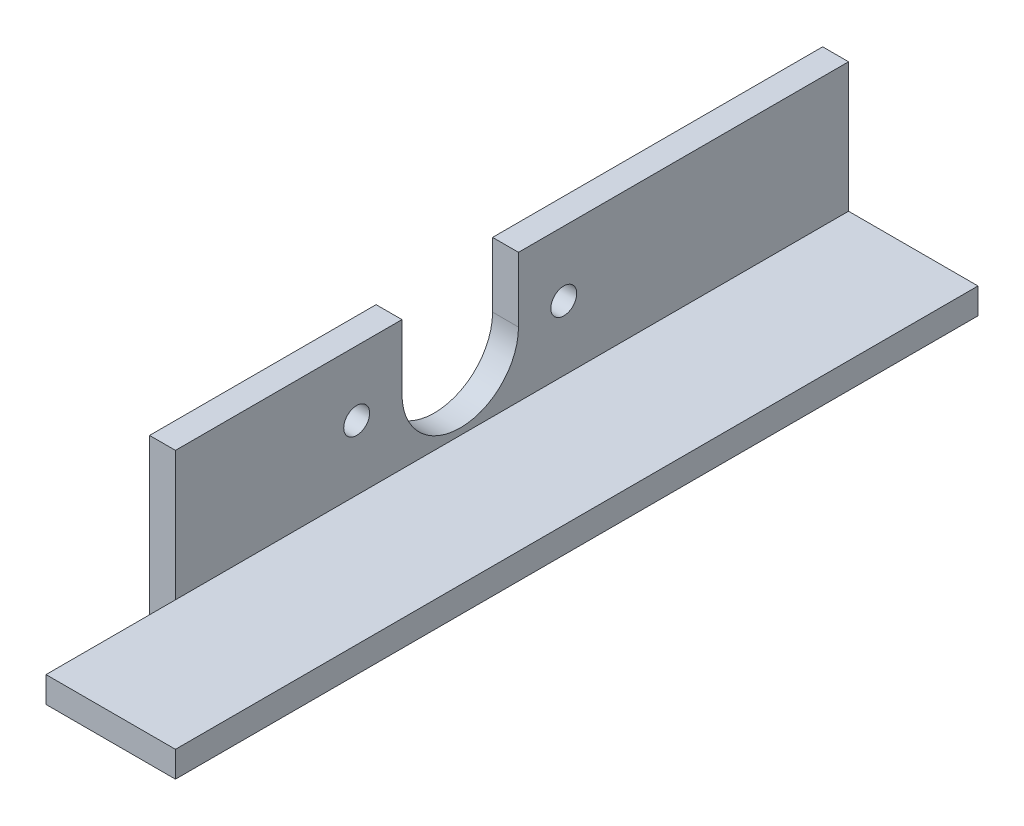
ISO-10303-21;
HEADER;
FILE_DESCRIPTION(('STEP AP214'),'2;1');
FILE_NAME('part.step','',(''),(''),'','','');
FILE_SCHEMA(('AUTOMOTIVE_DESIGN { 1 0 10303 214 1 1 1 1 }'));
ENDSEC;
DATA;
#1=APPLICATION_CONTEXT('core data for automotive mechanical design processes');
#2=APPLICATION_PROTOCOL_DEFINITION('international standard','automotive_design',2000,#1);
#3=PRODUCT_CONTEXT('',#1,'mechanical');
#4=PRODUCT('Part','Part','',(#3));
#5=PRODUCT_RELATED_PRODUCT_CATEGORY('part','',(#4));
#6=PRODUCT_DEFINITION_FORMATION('','',#4);
#7=PRODUCT_DEFINITION_CONTEXT('part definition',#1,'design');
#8=PRODUCT_DEFINITION('design','',#6,#7);
#9=PRODUCT_DEFINITION_SHAPE('','',#8);
#10=(LENGTH_UNIT() NAMED_UNIT(*) SI_UNIT(.MILLI.,.METRE.));
#11=(NAMED_UNIT(*) PLANE_ANGLE_UNIT() SI_UNIT($,.RADIAN.));
#12=(NAMED_UNIT(*) SI_UNIT($,.STERADIAN.) SOLID_ANGLE_UNIT());
#13=UNCERTAINTY_MEASURE_WITH_UNIT(LENGTH_MEASURE(1.E-05),#10,'distance_accuracy_value','');
#14=(GEOMETRIC_REPRESENTATION_CONTEXT(3) GLOBAL_UNCERTAINTY_ASSIGNED_CONTEXT((#13)) GLOBAL_UNIT_ASSIGNED_CONTEXT((#10,
#11,#12)) REPRESENTATION_CONTEXT('',''));
#15=CARTESIAN_POINT('',(0.,0.,0.));
#16=DIRECTION('',(0.,0.,1.));
#17=DIRECTION('',(1.,0.,0.));
#18=AXIS2_PLACEMENT_3D('',#15,#16,#17);
#19=CARTESIAN_POINT('',(0.,38.1,196.85));
#20=DIRECTION('',(0.,-1.,0.));
#21=DIRECTION('',(0.,0.,-1.));
#22=AXIS2_PLACEMENT_3D('',#19,#20,#21);
#23=PLANE('',#22);
#24=DIRECTION('',(0.,0.,-1.));
#25=VECTOR('',#24,1.);
#26=CARTESIAN_POINT('',(6.35,38.1,196.85));
#27=LINE('',#26,#25);
#28=CARTESIAN_POINT('',(6.35,38.1,165.1));
#29=VERTEX_POINT('',#28);
#30=CARTESIAN_POINT('',(6.35,38.1,109.5375));
#31=VERTEX_POINT('',#30);
#32=EDGE_CURVE('E237',#29,#31,#27,.T.);
#33=ORIENTED_EDGE('',*,*,#32,.T.);
#34=DIRECTION('',(1.,0.,0.));
#35=VECTOR('',#34,1.);
#36=CARTESIAN_POINT('',(0.,38.1,109.5375));
#37=LINE('',#36,#35);
#38=CARTESIAN_POINT('',(0.,38.1,109.5375));
#39=VERTEX_POINT('',#38);
#40=EDGE_CURVE('E174',#39,#31,#37,.T.);
#41=ORIENTED_EDGE('',*,*,#40,.F.);
#42=DIRECTION('',(0.,0.,-1.));
#43=VECTOR('',#42,1.);
#44=CARTESIAN_POINT('',(0.,38.1,196.85));
#45=LINE('',#44,#43);
#46=CARTESIAN_POINT('',(0.,38.1,165.1));
#47=VERTEX_POINT('',#46);
#48=EDGE_CURVE('E233',#47,#39,#45,.T.);
#49=ORIENTED_EDGE('',*,*,#48,.F.);
#50=DIRECTION('',(-1.,0.,0.));
#51=VECTOR('',#50,1.);
#52=CARTESIAN_POINT('',(6.35,38.1,165.1));
#53=LINE('',#52,#51);
#54=EDGE_CURVE('E186',#29,#47,#53,.T.);
#55=ORIENTED_EDGE('',*,*,#54,.F.);
#56=EDGE_LOOP('',(#33,#41,#49,#55));
#57=FACE_BOUND('',#56,.T.);
#58=ADVANCED_FACE('F45',(#57),#23,.F.);
#59=CARTESIAN_POINT('',(0.,0.,196.85));
#60=DIRECTION('',(0.,1.,0.));
#61=DIRECTION('',(-1.,0.,0.));
#62=AXIS2_PLACEMENT_3D('',#59,#60,#61);
#63=PLANE('',#62);
#64=DIRECTION('',(-1.,0.,0.));
#65=VECTOR('',#64,1.);
#66=CARTESIAN_POINT('',(6.35,4.16333634234434E-13,165.1));
#67=LINE('',#66,#65);
#68=CARTESIAN_POINT('',(6.35,4.16333634234434E-13,165.1));
#69=VERTEX_POINT('',#68);
#70=CARTESIAN_POINT('',(0.,4.16333634234434E-13,165.1));
#71=VERTEX_POINT('',#70);
#72=EDGE_CURVE('E192',#69,#71,#67,.T.);
#73=ORIENTED_EDGE('',*,*,#72,.T.);
#74=DIRECTION('',(0.,0.,-1.));
#75=VECTOR('',#74,1.);
#76=CARTESIAN_POINT('',(0.,0.,196.85));
#77=LINE('',#76,#75);
#78=CARTESIAN_POINT('',(0.,0.,0.));
#79=VERTEX_POINT('',#78);
#80=EDGE_CURVE('E208',#71,#79,#77,.T.);
#81=ORIENTED_EDGE('',*,*,#80,.T.);
#82=DIRECTION('',(1.,0.,0.));
#83=VECTOR('',#82,1.);
#84=CARTESIAN_POINT('',(0.,0.,0.));
#85=LINE('',#84,#83);
#86=CARTESIAN_POINT('',(38.1,4.16333634234434E-13,0.));
#87=VERTEX_POINT('',#86);
#88=EDGE_CURVE('E196',#79,#87,#85,.T.);
#89=ORIENTED_EDGE('',*,*,#88,.T.);
#90=DIRECTION('',(0.,0.,-1.));
#91=VECTOR('',#90,1.);
#92=CARTESIAN_POINT('',(38.1,4.16333634234434E-13,196.85));
#93=LINE('',#92,#91);
#94=CARTESIAN_POINT('',(38.1,4.16333634234434E-13,196.85));
#95=VERTEX_POINT('',#94);
#96=EDGE_CURVE('E54',#95,#87,#93,.T.);
#97=ORIENTED_EDGE('',*,*,#96,.F.);
#98=DIRECTION('',(1.,0.,0.));
#99=VECTOR('',#98,1.);
#100=CARTESIAN_POINT('',(0.,0.,196.85));
#101=LINE('',#100,#99);
#102=CARTESIAN_POINT('',(6.35,0.,196.85));
#103=VERTEX_POINT('',#102);
#104=EDGE_CURVE('E197',#103,#95,#101,.T.);
#105=ORIENTED_EDGE('',*,*,#104,.F.);
#106=DIRECTION('',(0.,0.,-1.));
#107=VECTOR('',#106,1.);
#108=CARTESIAN_POINT('',(6.35,4.16333634234434E-13,196.85));
#109=LINE('',#108,#107);
#110=EDGE_CURVE('E68',#103,#69,#109,.T.);
#111=ORIENTED_EDGE('',*,*,#110,.T.);
#112=EDGE_LOOP('',(#73,#81,#89,#97,#105,#111));
#113=FACE_BOUND('',#112,.T.);
#114=ADVANCED_FACE('F47',(#113),#63,.F.);
#115=CARTESIAN_POINT('',(6.35,38.1,196.85));
#116=DIRECTION('',(-1.,0.,0.));
#117=DIRECTION('',(0.,-1.,0.));
#118=AXIS2_PLACEMENT_3D('',#115,#116,#117);
#119=PLANE('',#118);
#120=CARTESIAN_POINT('',(6.35,22.225,69.85));
#121=DIRECTION('',(1.,0.,0.));
#122=DIRECTION('',(0.,-1.,0.));
#123=AXIS2_PLACEMENT_3D('',#120,#121,#122);
#124=CIRCLE('',#123,3.17500000000009);
#125=CARTESIAN_POINT('',(6.35,19.0499999999999,69.85));
#126=VERTEX_POINT('',#125);
#127=EDGE_CURVE('E494',#126,#126,#124,.T.);
#128=ORIENTED_EDGE('',*,*,#127,.F.);
#129=EDGE_LOOP('',(#128));
#130=FACE_BOUND('',#129,.T.);
#131=CARTESIAN_POINT('',(6.35,22.225,120.65));
#132=DIRECTION('',(1.,0.,0.));
#133=DIRECTION('',(0.,1.,0.));
#134=AXIS2_PLACEMENT_3D('',#131,#132,#133);
#135=CIRCLE('',#134,3.17500000000009);
#136=CARTESIAN_POINT('',(6.35,25.4000000000001,120.65));
#137=VERTEX_POINT('',#136);
#138=EDGE_CURVE('E167',#137,#137,#135,.T.);
#139=ORIENTED_EDGE('',*,*,#138,.F.);
#140=EDGE_LOOP('',(#139));
#141=FACE_BOUND('',#140,.T.);
#142=CARTESIAN_POINT('',(6.35,22.225,95.25));
#143=DIRECTION('',(1.,0.,0.));
#144=DIRECTION('',(0.,1.,0.));
#145=AXIS2_PLACEMENT_3D('',#142,#143,#144);
#146=CIRCLE('',#145,14.2875);
#147=CARTESIAN_POINT('',(6.35,22.225,109.5375));
#148=VERTEX_POINT('',#147);
#149=CARTESIAN_POINT('',(6.35,22.225,80.9625));
#150=VERTEX_POINT('',#149);
#151=EDGE_CURVE('E139',#148,#150,#146,.T.);
#152=ORIENTED_EDGE('',*,*,#151,.F.);
#153=DIRECTION('',(0.,-1.,0.));
#154=VECTOR('',#153,1.);
#155=CARTESIAN_POINT('',(6.35,22.225,109.5375));
#156=LINE('',#155,#154);
#157=EDGE_CURVE('E153',#31,#148,#156,.T.);
#158=ORIENTED_EDGE('',*,*,#157,.F.);
#159=ORIENTED_EDGE('',*,*,#32,.F.);
#160=DIRECTION('',(0.,1.,0.));
#161=VECTOR('',#160,1.);
#162=CARTESIAN_POINT('',(6.35,38.1,165.1));
#163=LINE('',#162,#161);
#164=CARTESIAN_POINT('',(6.35,6.35000000000007,165.1));
#165=VERTEX_POINT('',#164);
#166=EDGE_CURVE('E181',#165,#29,#163,.T.);
#167=ORIENTED_EDGE('',*,*,#166,.F.);
#168=DIRECTION('',(0.,0.,-1.));
#169=VECTOR('',#168,1.);
#170=CARTESIAN_POINT('',(6.35,6.35000000000007,196.85));
#171=LINE('',#170,#169);
#172=CARTESIAN_POINT('',(6.35,6.35000000000007,0.));
#173=VERTEX_POINT('',#172);
#174=EDGE_CURVE('E241',#165,#173,#171,.T.);
#175=ORIENTED_EDGE('',*,*,#174,.T.);
#176=DIRECTION('',(0.,1.,0.));
#177=VECTOR('',#176,1.);
#178=CARTESIAN_POINT('',(6.35,38.1,0.));
#179=LINE('',#178,#177);
#180=CARTESIAN_POINT('',(6.35,38.1,0.));
#181=VERTEX_POINT('',#180);
#182=EDGE_CURVE('E219',#173,#181,#179,.T.);
#183=ORIENTED_EDGE('',*,*,#182,.T.);
#184=CARTESIAN_POINT('',(6.35,38.1,80.9625));
#185=VERTEX_POINT('',#184);
#186=EDGE_CURVE('E236',#185,#181,#27,.T.);
#187=ORIENTED_EDGE('',*,*,#186,.F.);
#188=DIRECTION('',(0.,1.,0.));
#189=VECTOR('',#188,1.);
#190=CARTESIAN_POINT('',(6.35,22.225,80.9625));
#191=LINE('',#190,#189);
#192=EDGE_CURVE('E157',#150,#185,#191,.T.);
#193=ORIENTED_EDGE('',*,*,#192,.F.);
#194=EDGE_LOOP('',(#152,#158,#159,#167,#175,#183,#187,#193));
#195=FACE_BOUND('',#194,.T.);
#196=ADVANCED_FACE('F280',(#130,#141,#195),#119,.F.);
#197=CARTESIAN_POINT('',(0.,38.1,80.9625));
#198=VERTEX_POINT('',#197);
#199=CARTESIAN_POINT('',(0.,38.1,0.));
#200=VERTEX_POINT('',#199);
#201=EDGE_CURVE('E232',#198,#200,#45,.T.);
#202=ORIENTED_EDGE('',*,*,#201,.F.);
#203=DIRECTION('',(1.,0.,0.));
#204=VECTOR('',#203,1.);
#205=CARTESIAN_POINT('',(0.,38.1,80.9625));
#206=LINE('',#205,#204);
#207=EDGE_CURVE('E61',#198,#185,#206,.T.);
#208=ORIENTED_EDGE('',*,*,#207,.T.);
#209=ORIENTED_EDGE('',*,*,#186,.T.);
#210=DIRECTION('',(-1.,0.,0.));
#211=VECTOR('',#210,1.);
#212=CARTESIAN_POINT('',(0.,38.1,0.));
#213=LINE('',#212,#211);
#214=EDGE_CURVE('E223',#181,#200,#213,.T.);
#215=ORIENTED_EDGE('',*,*,#214,.T.);
#216=EDGE_LOOP('',(#202,#208,#209,#215));
#217=FACE_BOUND('',#216,.T.);
#218=ADVANCED_FACE('F276',(#217),#23,.F.);
#219=CARTESIAN_POINT('',(0.,0.,196.85));
#220=DIRECTION('',(1.,0.,0.));
#221=DIRECTION('',(0.,0.,-1.));
#222=AXIS2_PLACEMENT_3D('',#219,#220,#221);
#223=PLANE('',#222);
#224=CARTESIAN_POINT('',(0.,22.225,69.85));
#225=DIRECTION('',(1.,0.,0.));
#226=DIRECTION('',(0.,-1.,0.));
#227=AXIS2_PLACEMENT_3D('',#224,#225,#226);
#228=CIRCLE('',#227,3.17500000000009);
#229=CARTESIAN_POINT('',(0.,19.0499999999999,69.85));
#230=VERTEX_POINT('',#229);
#231=EDGE_CURVE('E160',#230,#230,#228,.T.);
#232=ORIENTED_EDGE('',*,*,#231,.T.);
#233=EDGE_LOOP('',(#232));
#234=FACE_BOUND('',#233,.T.);
#235=CARTESIAN_POINT('',(0.,22.225,120.65));
#236=DIRECTION('',(1.,0.,0.));
#237=DIRECTION('',(0.,1.,0.));
#238=AXIS2_PLACEMENT_3D('',#235,#236,#237);
#239=CIRCLE('',#238,3.17500000000009);
#240=CARTESIAN_POINT('',(0.,25.4000000000001,120.65));
#241=VERTEX_POINT('',#240);
#242=EDGE_CURVE('E496',#241,#241,#239,.T.);
#243=ORIENTED_EDGE('',*,*,#242,.T.);
#244=EDGE_LOOP('',(#243));
#245=FACE_BOUND('',#244,.T.);
#246=ORIENTED_EDGE('',*,*,#48,.T.);
#247=DIRECTION('',(0.,-1.,0.));
#248=VECTOR('',#247,1.);
#249=CARTESIAN_POINT('',(0.,22.225,109.5375));
#250=LINE('',#249,#248);
#251=CARTESIAN_POINT('',(0.,22.225,109.5375));
#252=VERTEX_POINT('',#251);
#253=EDGE_CURVE('E142',#39,#252,#250,.T.);
#254=ORIENTED_EDGE('',*,*,#253,.T.);
#255=CARTESIAN_POINT('',(0.,22.225,95.25));
#256=DIRECTION('',(1.,0.,0.));
#257=DIRECTION('',(0.,1.,0.));
#258=AXIS2_PLACEMENT_3D('',#255,#256,#257);
#259=CIRCLE('',#258,14.2875);
#260=CARTESIAN_POINT('',(0.,22.225,80.9625));
#261=VERTEX_POINT('',#260);
#262=EDGE_CURVE('E136',#252,#261,#259,.T.);
#263=ORIENTED_EDGE('',*,*,#262,.T.);
#264=DIRECTION('',(0.,1.,0.));
#265=VECTOR('',#264,1.);
#266=CARTESIAN_POINT('',(0.,22.225,80.9625));
#267=LINE('',#266,#265);
#268=EDGE_CURVE('E144',#261,#198,#267,.T.);
#269=ORIENTED_EDGE('',*,*,#268,.T.);
#270=ORIENTED_EDGE('',*,*,#201,.T.);
#271=DIRECTION('',(0.,-1.,0.));
#272=VECTOR('',#271,1.);
#273=CARTESIAN_POINT('',(0.,0.,0.));
#274=LINE('',#273,#272);
#275=EDGE_CURVE('E201',#200,#79,#274,.T.);
#276=ORIENTED_EDGE('',*,*,#275,.T.);
#277=ORIENTED_EDGE('',*,*,#80,.F.);
#278=DIRECTION('',(0.,1.,0.));
#279=VECTOR('',#278,1.);
#280=CARTESIAN_POINT('',(0.,38.1,165.1));
#281=LINE('',#280,#279);
#282=EDGE_CURVE('E173',#71,#47,#281,.T.);
#283=ORIENTED_EDGE('',*,*,#282,.T.);
#284=EDGE_LOOP('',(#246,#254,#263,#269,#270,#276,#277,#283));
#285=FACE_BOUND('',#284,.T.);
#286=ADVANCED_FACE('F151',(#234,#245,#285),#223,.F.);
#287=CARTESIAN_POINT('',(38.1,4.16333634234434E-13,196.85));
#288=DIRECTION('',(-1.,0.,0.));
#289=DIRECTION('',(0.,-1.,0.));
#290=AXIS2_PLACEMENT_3D('',#287,#288,#289);
#291=PLANE('',#290);
#292=DIRECTION('',(0.,1.,0.));
#293=VECTOR('',#292,1.);
#294=CARTESIAN_POINT('',(38.1,4.16333634234434E-13,0.));
#295=LINE('',#294,#293);
#296=CARTESIAN_POINT('',(38.0999999999999,6.35000000000041,0.));
#297=VERTEX_POINT('',#296);
#298=EDGE_CURVE('E212',#87,#297,#295,.T.);
#299=ORIENTED_EDGE('',*,*,#298,.T.);
#300=DIRECTION('',(0.,0.,-1.));
#301=VECTOR('',#300,1.);
#302=CARTESIAN_POINT('',(38.0999999999999,6.35000000000041,196.85));
#303=LINE('',#302,#301);
#304=CARTESIAN_POINT('',(38.0999999999999,6.35000000000041,196.85));
#305=VERTEX_POINT('',#304);
#306=EDGE_CURVE('E245',#305,#297,#303,.T.);
#307=ORIENTED_EDGE('',*,*,#306,.F.);
#308=DIRECTION('',(0.,1.,0.));
#309=VECTOR('',#308,1.);
#310=CARTESIAN_POINT('',(38.1,4.16333634234434E-13,196.85));
#311=LINE('',#310,#309);
#312=EDGE_CURVE('E200',#95,#305,#311,.T.);
#313=ORIENTED_EDGE('',*,*,#312,.F.);
#314=ORIENTED_EDGE('',*,*,#96,.T.);
#315=EDGE_LOOP('',(#299,#307,#313,#314));
#316=FACE_BOUND('',#315,.T.);
#317=ADVANCED_FACE('F253',(#316),#291,.F.);
#318=CARTESIAN_POINT('',(38.0999999999999,6.35000000000041,196.85));
#319=DIRECTION('',(0.,-1.,0.));
#320=DIRECTION('',(1.,0.,0.));
#321=AXIS2_PLACEMENT_3D('',#318,#319,#320);
#322=PLANE('',#321);
#323=DIRECTION('',(-1.,0.,0.));
#324=VECTOR('',#323,1.);
#325=CARTESIAN_POINT('',(38.0999999999999,6.35000000000041,0.));
#326=LINE('',#325,#324);
#327=EDGE_CURVE('E215',#297,#173,#326,.T.);
#328=ORIENTED_EDGE('',*,*,#327,.T.);
#329=ORIENTED_EDGE('',*,*,#174,.F.);
#330=CARTESIAN_POINT('',(6.35,6.35000000000024,196.85));
#331=VERTEX_POINT('',#330);
#332=EDGE_CURVE('E242',#331,#165,#171,.T.);
#333=ORIENTED_EDGE('',*,*,#332,.F.);
#334=DIRECTION('',(-1.,0.,0.));
#335=VECTOR('',#334,1.);
#336=CARTESIAN_POINT('',(38.0999999999999,6.35000000000041,196.85));
#337=LINE('',#336,#335);
#338=EDGE_CURVE('E204',#305,#331,#337,.T.);
#339=ORIENTED_EDGE('',*,*,#338,.F.);
#340=ORIENTED_EDGE('',*,*,#306,.T.);
#341=EDGE_LOOP('',(#328,#329,#333,#339,#340));
#342=FACE_BOUND('',#341,.T.);
#343=ADVANCED_FACE('F267',(#342),#322,.F.);
#344=CARTESIAN_POINT('',(0.,0.,196.85));
#345=DIRECTION('',(0.,0.,1.));
#346=DIRECTION('',(1.,0.,0.));
#347=AXIS2_PLACEMENT_3D('',#344,#345,#346);
#348=PLANE('',#347);
#349=DIRECTION('',(0.,1.,0.));
#350=VECTOR('',#349,1.);
#351=CARTESIAN_POINT('',(6.35,0.,196.85));
#352=LINE('',#351,#350);
#353=EDGE_CURVE('E11',#103,#331,#352,.T.);
#354=ORIENTED_EDGE('',*,*,#353,.F.);
#355=ORIENTED_EDGE('',*,*,#104,.T.);
#356=ORIENTED_EDGE('',*,*,#312,.T.);
#357=ORIENTED_EDGE('',*,*,#338,.T.);
#358=EDGE_LOOP('',(#354,#355,#356,#357));
#359=FACE_BOUND('',#358,.T.);
#360=ADVANCED_FACE('F271',(#359),#348,.T.);
#361=CARTESIAN_POINT('',(0.,0.,0.));
#362=DIRECTION('',(0.,0.,1.));
#363=DIRECTION('',(1.,0.,0.));
#364=AXIS2_PLACEMENT_3D('',#361,#362,#363);
#365=PLANE('',#364);
#366=ORIENTED_EDGE('',*,*,#88,.F.);
#367=ORIENTED_EDGE('',*,*,#275,.F.);
#368=ORIENTED_EDGE('',*,*,#214,.F.);
#369=ORIENTED_EDGE('',*,*,#182,.F.);
#370=ORIENTED_EDGE('',*,*,#327,.F.);
#371=ORIENTED_EDGE('',*,*,#298,.F.);
#372=EDGE_LOOP('',(#366,#367,#368,#369,#370,#371));
#373=FACE_BOUND('',#372,.T.);
#374=ADVANCED_FACE('F261',(#373),#365,.F.);
#375=CARTESIAN_POINT('',(6.35,0.,0.));
#376=DIRECTION('',(1.,0.,0.));
#377=DIRECTION('',(0.,0.,-1.));
#378=AXIS2_PLACEMENT_3D('',#375,#376,#377);
#379=PLANE('',#378);
#380=EDGE_CURVE('E182',#69,#165,#163,.T.);
#381=ORIENTED_EDGE('',*,*,#380,.F.);
#382=ORIENTED_EDGE('',*,*,#110,.F.);
#383=ORIENTED_EDGE('',*,*,#353,.T.);
#384=ORIENTED_EDGE('',*,*,#332,.T.);
#385=EDGE_LOOP('',(#381,#382,#383,#384));
#386=FACE_BOUND('',#385,.T.);
#387=ADVANCED_FACE('F343',(#386),#379,.F.);
#388=CARTESIAN_POINT('',(6.35,38.1,165.1));
#389=DIRECTION('',(0.,0.,1.));
#390=DIRECTION('',(1.,0.,0.));
#391=AXIS2_PLACEMENT_3D('',#388,#389,#390);
#392=PLANE('',#391);
#393=ORIENTED_EDGE('',*,*,#282,.F.);
#394=ORIENTED_EDGE('',*,*,#72,.F.);
#395=ORIENTED_EDGE('',*,*,#380,.T.);
#396=ORIENTED_EDGE('',*,*,#166,.T.);
#397=ORIENTED_EDGE('',*,*,#54,.T.);
#398=EDGE_LOOP('',(#393,#394,#395,#396,#397));
#399=FACE_BOUND('',#398,.T.);
#400=ADVANCED_FACE('F286',(#399),#392,.T.);
#401=CARTESIAN_POINT('',(0.,22.225,95.25));
#402=DIRECTION('',(1.,0.,0.));
#403=DIRECTION('',(0.,1.,0.));
#404=AXIS2_PLACEMENT_3D('',#401,#402,#403);
#405=CYLINDRICAL_SURFACE('',#404,14.2875);
#406=ORIENTED_EDGE('',*,*,#151,.T.);
#407=DIRECTION('',(1.,0.,0.));
#408=VECTOR('',#407,1.);
#409=CARTESIAN_POINT('',(0.,22.225,80.9625));
#410=LINE('',#409,#408);
#411=EDGE_CURVE('E133',#261,#150,#410,.T.);
#412=ORIENTED_EDGE('',*,*,#411,.F.);
#413=ORIENTED_EDGE('',*,*,#262,.F.);
#414=DIRECTION('',(1.,0.,0.));
#415=VECTOR('',#414,1.);
#416=CARTESIAN_POINT('',(0.,22.225,109.5375));
#417=LINE('',#416,#415);
#418=EDGE_CURVE('E170',#252,#148,#417,.T.);
#419=ORIENTED_EDGE('',*,*,#418,.T.);
#420=EDGE_LOOP('',(#406,#412,#413,#419));
#421=FACE_BOUND('',#420,.T.);
#422=ADVANCED_FACE('F134',(#421),#405,.F.);
#423=CARTESIAN_POINT('',(0.,22.225,109.5375));
#424=DIRECTION('',(0.,0.,1.));
#425=DIRECTION('',(0.,-1.,0.));
#426=AXIS2_PLACEMENT_3D('',#423,#424,#425);
#427=PLANE('',#426);
#428=ORIENTED_EDGE('',*,*,#157,.T.);
#429=ORIENTED_EDGE('',*,*,#418,.F.);
#430=ORIENTED_EDGE('',*,*,#253,.F.);
#431=ORIENTED_EDGE('',*,*,#40,.T.);
#432=EDGE_LOOP('',(#428,#429,#430,#431));
#433=FACE_BOUND('',#432,.T.);
#434=ADVANCED_FACE('F291',(#433),#427,.F.);
#435=CARTESIAN_POINT('',(0.,22.225,80.9625));
#436=DIRECTION('',(0.,0.,-1.));
#437=DIRECTION('',(0.,1.,0.));
#438=AXIS2_PLACEMENT_3D('',#435,#436,#437);
#439=PLANE('',#438);
#440=ORIENTED_EDGE('',*,*,#192,.T.);
#441=ORIENTED_EDGE('',*,*,#207,.F.);
#442=ORIENTED_EDGE('',*,*,#268,.F.);
#443=ORIENTED_EDGE('',*,*,#411,.T.);
#444=EDGE_LOOP('',(#440,#441,#442,#443));
#445=FACE_BOUND('',#444,.T.);
#446=ADVANCED_FACE('F145',(#445),#439,.F.);
#447=CARTESIAN_POINT('',(0.,22.225,120.65));
#448=DIRECTION('',(1.,0.,0.));
#449=DIRECTION('',(0.,1.,0.));
#450=AXIS2_PLACEMENT_3D('',#447,#448,#449);
#451=CYLINDRICAL_SURFACE('',#450,3.17500000000009);
#452=ORIENTED_EDGE('',*,*,#242,.F.);
#453=EDGE_LOOP('',(#452));
#454=FACE_BOUND('',#453,.T.);
#455=ORIENTED_EDGE('',*,*,#138,.T.);
#456=EDGE_LOOP('',(#455));
#457=FACE_BOUND('',#456,.T.);
#458=ADVANCED_FACE('F298',(#454,#457),#451,.F.);
#459=CARTESIAN_POINT('',(0.,22.225,69.85));
#460=DIRECTION('',(1.,0.,0.));
#461=DIRECTION('',(0.,1.,0.));
#462=AXIS2_PLACEMENT_3D('',#459,#460,#461);
#463=CYLINDRICAL_SURFACE('',#462,3.17500000000009);
#464=ORIENTED_EDGE('',*,*,#231,.F.);
#465=EDGE_LOOP('',(#464));
#466=FACE_BOUND('',#465,.T.);
#467=ORIENTED_EDGE('',*,*,#127,.T.);
#468=EDGE_LOOP('',(#467));
#469=FACE_BOUND('',#468,.T.);
#470=ADVANCED_FACE('F380',(#466,#469),#463,.F.);
#471=CLOSED_SHELL('',(#58,#114,#196,#218,#286,#317,#343,#360,#374,#387,#400,#422,#434,#446,#458,#470));
#472=MANIFOLD_SOLID_BREP('B2',#471);
#473=ADVANCED_BREP_SHAPE_REPRESENTATION('',(#18,#472),#14);
#474=SHAPE_DEFINITION_REPRESENTATION(#9,#473);
ENDSEC;
END-ISO-10303-21;
